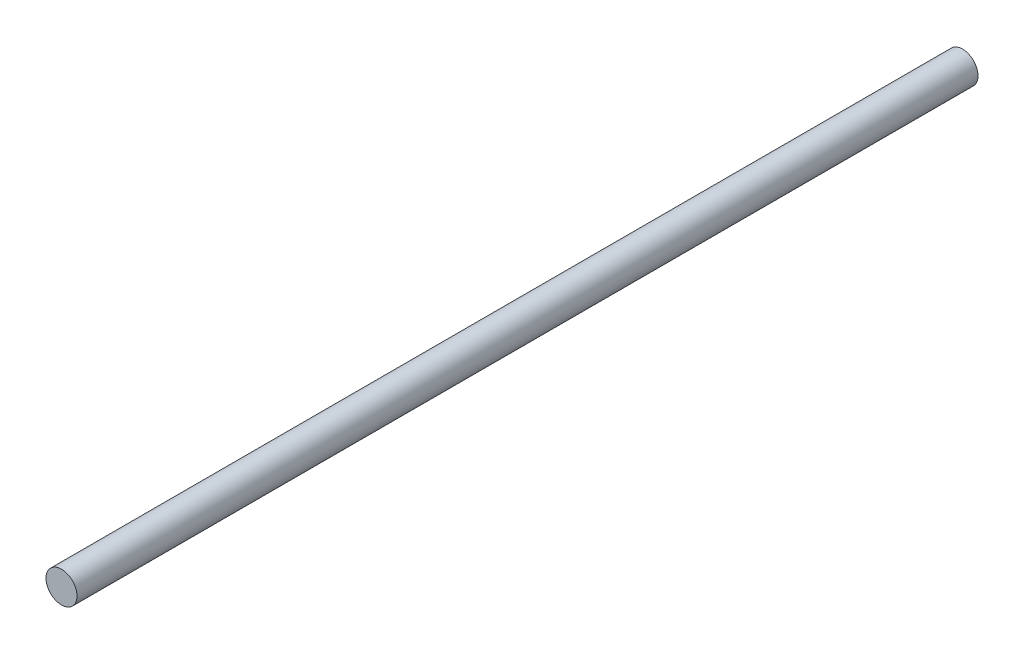
ISO-10303-21;
HEADER;
FILE_DESCRIPTION(('STEP AP214'),'2;1');
FILE_NAME('part.step','',(''),(''),'','','');
FILE_SCHEMA(('AUTOMOTIVE_DESIGN { 1 0 10303 214 1 1 1 1 }'));
ENDSEC;
DATA;
#1=APPLICATION_CONTEXT('core data for automotive mechanical design processes');
#2=APPLICATION_PROTOCOL_DEFINITION('international standard','automotive_design',2000,#1);
#3=PRODUCT_CONTEXT('',#1,'mechanical');
#4=PRODUCT('Part','Part','',(#3));
#5=PRODUCT_RELATED_PRODUCT_CATEGORY('part','',(#4));
#6=PRODUCT_DEFINITION_FORMATION('','',#4);
#7=PRODUCT_DEFINITION_CONTEXT('part definition',#1,'design');
#8=PRODUCT_DEFINITION('design','',#6,#7);
#9=PRODUCT_DEFINITION_SHAPE('','',#8);
#10=(LENGTH_UNIT() NAMED_UNIT(*) SI_UNIT(.MILLI.,.METRE.));
#11=(NAMED_UNIT(*) PLANE_ANGLE_UNIT() SI_UNIT($,.RADIAN.));
#12=(NAMED_UNIT(*) SI_UNIT($,.STERADIAN.) SOLID_ANGLE_UNIT());
#13=UNCERTAINTY_MEASURE_WITH_UNIT(LENGTH_MEASURE(1.E-05),#10,'distance_accuracy_value','');
#14=(GEOMETRIC_REPRESENTATION_CONTEXT(3) GLOBAL_UNCERTAINTY_ASSIGNED_CONTEXT((#13)) GLOBAL_UNIT_ASSIGNED_CONTEXT((#10,
#11,#12)) REPRESENTATION_CONTEXT('',''));
#15=CARTESIAN_POINT('',(0.,0.,0.));
#16=DIRECTION('',(0.,0.,1.));
#17=DIRECTION('',(1.,0.,0.));
#18=AXIS2_PLACEMENT_3D('',#15,#16,#17);
#19=CARTESIAN_POINT('',(0.,0.,0.));
#20=DIRECTION('',(0.,0.,1.));
#21=DIRECTION('',(0.,-1.,0.));
#22=AXIS2_PLACEMENT_3D('',#19,#20,#21);
#23=PLANE('',#22);
#24=CARTESIAN_POINT('',(0.,0.,0.));
#25=DIRECTION('',(0.,0.,-1.));
#26=DIRECTION('',(0.,1.,0.));
#27=AXIS2_PLACEMENT_3D('',#24,#25,#26);
#28=CIRCLE('',#27,4.);
#29=CARTESIAN_POINT('',(0.,4.,0.));
#30=VERTEX_POINT('',#29);
#31=EDGE_CURVE('E10',#30,#30,#28,.T.);
#32=ORIENTED_EDGE('',*,*,#31,.F.);
#33=EDGE_LOOP('',(#32));
#34=FACE_BOUND('',#33,.T.);
#35=ADVANCED_FACE('F33',(#34),#23,.T.);
#36=CARTESIAN_POINT('',(0.,0.,0.));
#37=DIRECTION('',(0.,0.,-1.));
#38=DIRECTION('',(0.,1.,0.));
#39=AXIS2_PLACEMENT_3D('',#36,#37,#38);
#40=CYLINDRICAL_SURFACE('',#39,3.99999999999999);
#41=ORIENTED_EDGE('',*,*,#31,.T.);
#42=EDGE_LOOP('',(#41));
#43=FACE_BOUND('',#42,.T.);
#44=CARTESIAN_POINT('',(0.,0.,-232.347675392386));
#45=DIRECTION('',(0.,0.,-1.));
#46=DIRECTION('',(0.,1.,0.));
#47=AXIS2_PLACEMENT_3D('',#44,#45,#46);
#48=CIRCLE('',#47,3.99999999999997);
#49=CARTESIAN_POINT('',(0.,4.,-232.347675392386));
#50=VERTEX_POINT('',#49);
#51=EDGE_CURVE('E39',#50,#50,#48,.T.);
#52=ORIENTED_EDGE('',*,*,#51,.F.);
#53=EDGE_LOOP('',(#52));
#54=FACE_BOUND('',#53,.T.);
#55=ADVANCED_FACE('F47',(#43,#54),#40,.T.);
#56=CARTESIAN_POINT('',(0.,0.,-232.347675392386));
#57=DIRECTION('',(0.,0.,-1.));
#58=DIRECTION('',(0.,1.,0.));
#59=AXIS2_PLACEMENT_3D('',#56,#57,#58);
#60=PLANE('',#59);
#61=ORIENTED_EDGE('',*,*,#51,.T.);
#62=EDGE_LOOP('',(#61));
#63=FACE_BOUND('',#62,.T.);
#64=ADVANCED_FACE('F45',(#63),#60,.T.);
#65=CLOSED_SHELL('',(#35,#55,#64));
#66=MANIFOLD_SOLID_BREP('B2',#65);
#67=ADVANCED_BREP_SHAPE_REPRESENTATION('',(#18,#66),#14);
#68=SHAPE_DEFINITION_REPRESENTATION(#9,#67);
ENDSEC;
END-ISO-10303-21;
